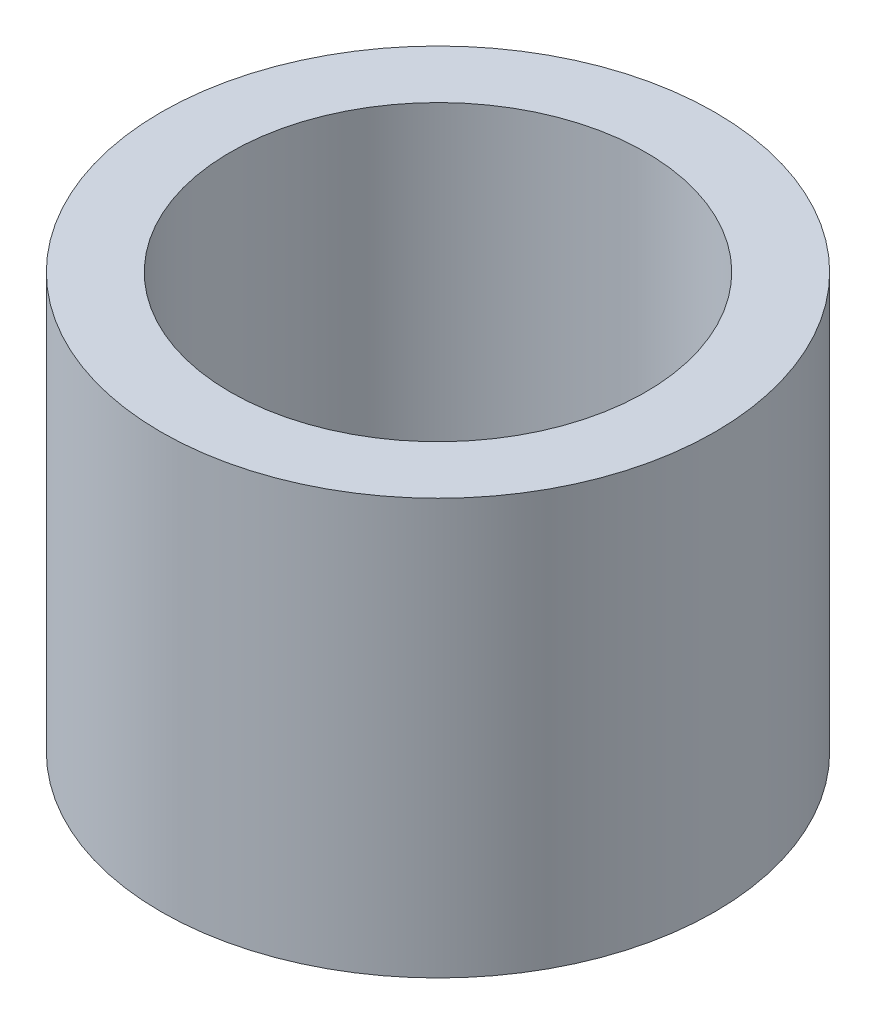
ISO-10303-21;
HEADER;
FILE_DESCRIPTION(('STEP AP214'),'2;1');
FILE_NAME('part.step','',(''),(''),'','','');
FILE_SCHEMA(('AUTOMOTIVE_DESIGN { 1 0 10303 214 1 1 1 1 }'));
ENDSEC;
DATA;
#1=APPLICATION_CONTEXT('core data for automotive mechanical design processes');
#2=APPLICATION_PROTOCOL_DEFINITION('international standard','automotive_design',2000,#1);
#3=PRODUCT_CONTEXT('',#1,'mechanical');
#4=PRODUCT('Part','Part','',(#3));
#5=PRODUCT_RELATED_PRODUCT_CATEGORY('part','',(#4));
#6=PRODUCT_DEFINITION_FORMATION('','',#4);
#7=PRODUCT_DEFINITION_CONTEXT('part definition',#1,'design');
#8=PRODUCT_DEFINITION('design','',#6,#7);
#9=PRODUCT_DEFINITION_SHAPE('','',#8);
#10=(LENGTH_UNIT() NAMED_UNIT(*) SI_UNIT(.MILLI.,.METRE.));
#11=(NAMED_UNIT(*) PLANE_ANGLE_UNIT() SI_UNIT($,.RADIAN.));
#12=(NAMED_UNIT(*) SI_UNIT($,.STERADIAN.) SOLID_ANGLE_UNIT());
#13=UNCERTAINTY_MEASURE_WITH_UNIT(LENGTH_MEASURE(1.E-05),#10,'distance_accuracy_value','');
#14=(GEOMETRIC_REPRESENTATION_CONTEXT(3) GLOBAL_UNCERTAINTY_ASSIGNED_CONTEXT((#13)) GLOBAL_UNIT_ASSIGNED_CONTEXT((#10,
#11,#12)) REPRESENTATION_CONTEXT('',''));
#15=CARTESIAN_POINT('',(0.,0.,0.));
#16=DIRECTION('',(0.,0.,1.));
#17=DIRECTION('',(1.,0.,0.));
#18=AXIS2_PLACEMENT_3D('',#15,#16,#17);
#19=CARTESIAN_POINT('',(0.,38.1,0.));
#20=DIRECTION('',(0.,1.,0.));
#21=DIRECTION('',(0.,0.,1.));
#22=AXIS2_PLACEMENT_3D('',#19,#20,#21);
#23=PLANE('',#22);
#24=CARTESIAN_POINT('',(0.,38.1,0.));
#25=DIRECTION('',(0.,1.,0.));
#26=DIRECTION('',(0.,0.,1.));
#27=AXIS2_PLACEMENT_3D('',#24,#25,#26);
#28=CIRCLE('',#27,25.4);
#29=CARTESIAN_POINT('',(0.,38.1,25.4));
#30=VERTEX_POINT('',#29);
#31=EDGE_CURVE('E10',#30,#30,#28,.T.);
#32=ORIENTED_EDGE('',*,*,#31,.T.);
#33=EDGE_LOOP('',(#32));
#34=FACE_BOUND('',#33,.T.);
#35=CARTESIAN_POINT('',(0.,38.1,0.));
#36=DIRECTION('',(0.,1.,0.));
#37=DIRECTION('',(0.,0.,1.));
#38=AXIS2_PLACEMENT_3D('',#35,#36,#37);
#39=CIRCLE('',#38,19.05);
#40=CARTESIAN_POINT('',(0.,38.1,19.05));
#41=VERTEX_POINT('',#40);
#42=EDGE_CURVE('E26',#41,#41,#39,.T.);
#43=ORIENTED_EDGE('',*,*,#42,.F.);
#44=EDGE_LOOP('',(#43));
#45=FACE_BOUND('',#44,.T.);
#46=ADVANCED_FACE('F15',(#34,#45),#23,.T.);
#47=CARTESIAN_POINT('',(0.,0.,0.));
#48=DIRECTION('',(0.,1.,0.));
#49=DIRECTION('',(0.,0.,1.));
#50=AXIS2_PLACEMENT_3D('',#47,#48,#49);
#51=PLANE('',#50);
#52=CARTESIAN_POINT('',(0.,0.,0.));
#53=DIRECTION('',(0.,1.,0.));
#54=DIRECTION('',(0.,0.,1.));
#55=AXIS2_PLACEMENT_3D('',#52,#53,#54);
#56=CIRCLE('',#55,25.4);
#57=CARTESIAN_POINT('',(0.,0.,25.4));
#58=VERTEX_POINT('',#57);
#59=EDGE_CURVE('E19',#58,#58,#56,.T.);
#60=ORIENTED_EDGE('',*,*,#59,.F.);
#61=EDGE_LOOP('',(#60));
#62=FACE_BOUND('',#61,.T.);
#63=CARTESIAN_POINT('',(0.,0.,0.));
#64=DIRECTION('',(0.,1.,0.));
#65=DIRECTION('',(0.,0.,1.));
#66=AXIS2_PLACEMENT_3D('',#63,#64,#65);
#67=CIRCLE('',#66,19.05);
#68=CARTESIAN_POINT('',(0.,0.,19.05));
#69=VERTEX_POINT('',#68);
#70=EDGE_CURVE('E28',#69,#69,#67,.T.);
#71=ORIENTED_EDGE('',*,*,#70,.T.);
#72=EDGE_LOOP('',(#71));
#73=FACE_BOUND('',#72,.T.);
#74=ADVANCED_FACE('F38',(#62,#73),#51,.F.);
#75=CARTESIAN_POINT('',(0.,38.1,0.));
#76=DIRECTION('',(0.,-1.,0.));
#77=DIRECTION('',(0.,0.,-1.));
#78=AXIS2_PLACEMENT_3D('',#75,#76,#77);
#79=CYLINDRICAL_SURFACE('',#78,25.4);
#80=ORIENTED_EDGE('',*,*,#31,.F.);
#81=EDGE_LOOP('',(#80));
#82=FACE_BOUND('',#81,.T.);
#83=ORIENTED_EDGE('',*,*,#59,.T.);
#84=EDGE_LOOP('',(#83));
#85=FACE_BOUND('',#84,.T.);
#86=ADVANCED_FACE('F17',(#82,#85),#79,.T.);
#87=CARTESIAN_POINT('',(0.,38.1,0.));
#88=DIRECTION('',(0.,-1.,0.));
#89=DIRECTION('',(0.,0.,-1.));
#90=AXIS2_PLACEMENT_3D('',#87,#88,#89);
#91=CYLINDRICAL_SURFACE('',#90,19.05);
#92=ORIENTED_EDGE('',*,*,#42,.T.);
#93=EDGE_LOOP('',(#92));
#94=FACE_BOUND('',#93,.T.);
#95=ORIENTED_EDGE('',*,*,#70,.F.);
#96=EDGE_LOOP('',(#95));
#97=FACE_BOUND('',#96,.T.);
#98=ADVANCED_FACE('F34',(#94,#97),#91,.F.);
#99=CLOSED_SHELL('',(#46,#74,#86,#98));
#100=MANIFOLD_SOLID_BREP('B1',#99);
#101=ADVANCED_BREP_SHAPE_REPRESENTATION('',(#18,#100),#14);
#102=SHAPE_DEFINITION_REPRESENTATION(#9,#101);
ENDSEC;
END-ISO-10303-21;
